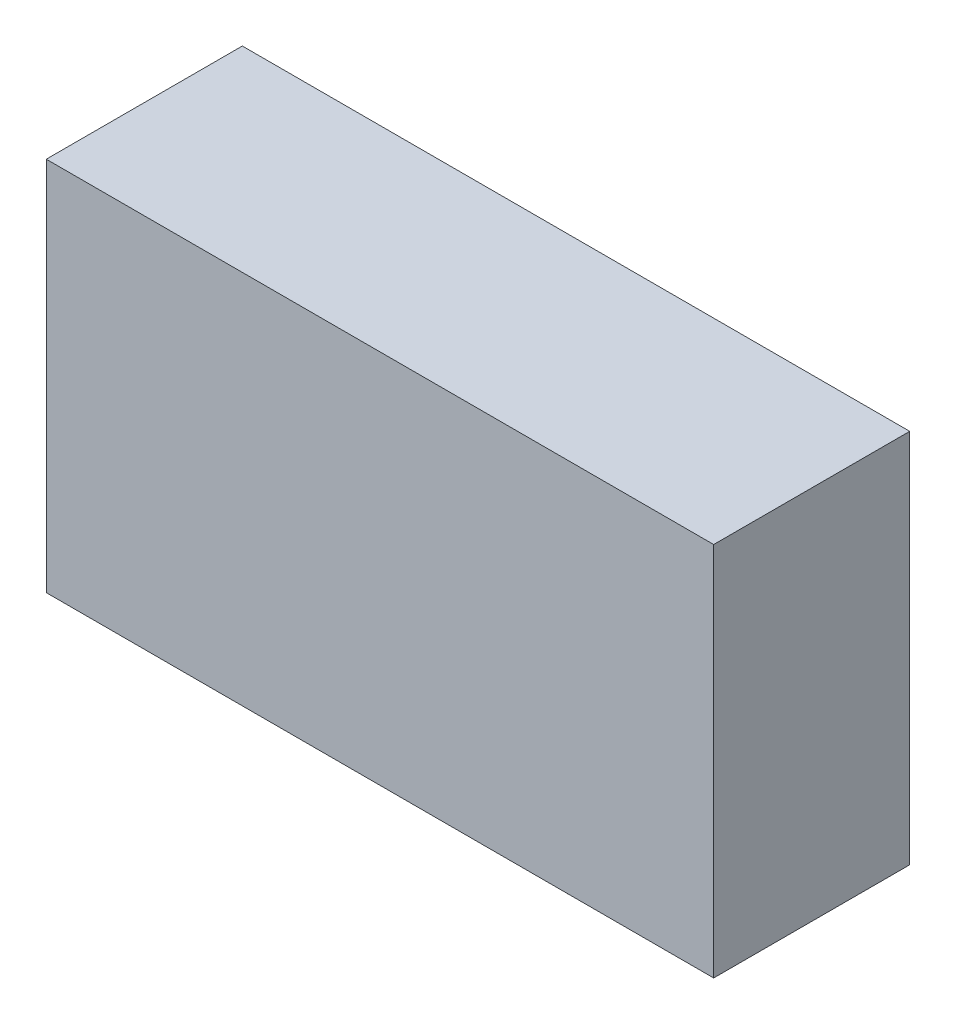
ISO-10303-21;
HEADER;
FILE_DESCRIPTION(('STEP AP214'),'2;1');
FILE_NAME('part.step','',(''),(''),'','','');
FILE_SCHEMA(('AUTOMOTIVE_DESIGN { 1 0 10303 214 1 1 1 1 }'));
ENDSEC;
DATA;
#1=APPLICATION_CONTEXT('core data for automotive mechanical design processes');
#2=APPLICATION_PROTOCOL_DEFINITION('international standard','automotive_design',2000,#1);
#3=PRODUCT_CONTEXT('',#1,'mechanical');
#4=PRODUCT('Part','Part','',(#3));
#5=PRODUCT_RELATED_PRODUCT_CATEGORY('part','',(#4));
#6=PRODUCT_DEFINITION_FORMATION('','',#4);
#7=PRODUCT_DEFINITION_CONTEXT('part definition',#1,'design');
#8=PRODUCT_DEFINITION('design','',#6,#7);
#9=PRODUCT_DEFINITION_SHAPE('','',#8);
#10=(LENGTH_UNIT() NAMED_UNIT(*) SI_UNIT(.MILLI.,.METRE.));
#11=(NAMED_UNIT(*) PLANE_ANGLE_UNIT() SI_UNIT($,.RADIAN.));
#12=(NAMED_UNIT(*) SI_UNIT($,.STERADIAN.) SOLID_ANGLE_UNIT());
#13=UNCERTAINTY_MEASURE_WITH_UNIT(LENGTH_MEASURE(1.E-05),#10,'distance_accuracy_value','');
#14=(GEOMETRIC_REPRESENTATION_CONTEXT(3) GLOBAL_UNCERTAINTY_ASSIGNED_CONTEXT((#13)) GLOBAL_UNIT_ASSIGNED_CONTEXT((#10,
#11,#12)) REPRESENTATION_CONTEXT('',''));
#15=CARTESIAN_POINT('',(0.,0.,0.));
#16=DIRECTION('',(0.,0.,1.));
#17=DIRECTION('',(1.,0.,0.));
#18=AXIS2_PLACEMENT_3D('',#15,#16,#17);
#19=CARTESIAN_POINT('',(0.,0.,2.35));
#20=DIRECTION('',(1.,0.,0.));
#21=DIRECTION('',(0.,0.,-1.));
#22=AXIS2_PLACEMENT_3D('',#19,#20,#21);
#23=PLANE('',#22);
#24=DIRECTION('',(0.,-1.,0.));
#25=VECTOR('',#24,1.);
#26=CARTESIAN_POINT('',(0.,0.,0.));
#27=LINE('',#26,#25);
#28=CARTESIAN_POINT('',(0.,4.49999999999996,0.));
#29=VERTEX_POINT('',#28);
#30=CARTESIAN_POINT('',(0.,0.,0.));
#31=VERTEX_POINT('',#30);
#32=EDGE_CURVE('E99',#29,#31,#27,.T.);
#33=ORIENTED_EDGE('',*,*,#32,.T.);
#34=DIRECTION('',(0.,0.,-1.));
#35=VECTOR('',#34,1.);
#36=CARTESIAN_POINT('',(0.,0.,2.35));
#37=LINE('',#36,#35);
#38=CARTESIAN_POINT('',(0.,0.,2.35));
#39=VERTEX_POINT('',#38);
#40=EDGE_CURVE('E11',#39,#31,#37,.T.);
#41=ORIENTED_EDGE('',*,*,#40,.F.);
#42=DIRECTION('',(0.,-1.,0.));
#43=VECTOR('',#42,1.);
#44=CARTESIAN_POINT('',(0.,0.,2.35));
#45=LINE('',#44,#43);
#46=CARTESIAN_POINT('',(0.,4.49999999999996,2.35));
#47=VERTEX_POINT('',#46);
#48=EDGE_CURVE('E87',#47,#39,#45,.T.);
#49=ORIENTED_EDGE('',*,*,#48,.F.);
#50=DIRECTION('',(0.,0.,-1.));
#51=VECTOR('',#50,1.);
#52=CARTESIAN_POINT('',(0.,4.49999999999996,2.35));
#53=LINE('',#52,#51);
#54=EDGE_CURVE('E95',#47,#29,#53,.T.);
#55=ORIENTED_EDGE('',*,*,#54,.T.);
#56=EDGE_LOOP('',(#33,#41,#49,#55));
#57=FACE_BOUND('',#56,.T.);
#58=ADVANCED_FACE('F36',(#57),#23,.F.);
#59=CARTESIAN_POINT('',(0.,0.,2.35));
#60=DIRECTION('',(0.,1.,0.));
#61=DIRECTION('',(0.,0.,1.));
#62=AXIS2_PLACEMENT_3D('',#59,#60,#61);
#63=PLANE('',#62);
#64=DIRECTION('',(1.,0.,0.));
#65=VECTOR('',#64,1.);
#66=CARTESIAN_POINT('',(0.,0.,0.));
#67=LINE('',#66,#65);
#68=CARTESIAN_POINT('',(8.,0.,0.));
#69=VERTEX_POINT('',#68);
#70=EDGE_CURVE('E91',#31,#69,#67,.T.);
#71=ORIENTED_EDGE('',*,*,#70,.T.);
#72=DIRECTION('',(0.,0.,-1.));
#73=VECTOR('',#72,1.);
#74=CARTESIAN_POINT('',(8.,0.,2.35));
#75=LINE('',#74,#73);
#76=CARTESIAN_POINT('',(8.,0.,2.35));
#77=VERTEX_POINT('',#76);
#78=EDGE_CURVE('E44',#77,#69,#75,.T.);
#79=ORIENTED_EDGE('',*,*,#78,.F.);
#80=DIRECTION('',(1.,0.,0.));
#81=VECTOR('',#80,1.);
#82=CARTESIAN_POINT('',(0.,0.,2.35));
#83=LINE('',#82,#81);
#84=EDGE_CURVE('E82',#39,#77,#83,.T.);
#85=ORIENTED_EDGE('',*,*,#84,.F.);
#86=ORIENTED_EDGE('',*,*,#40,.T.);
#87=EDGE_LOOP('',(#71,#79,#85,#86));
#88=FACE_BOUND('',#87,.T.);
#89=ADVANCED_FACE('F90',(#88),#63,.F.);
#90=CARTESIAN_POINT('',(8.,0.,2.35));
#91=DIRECTION('',(-1.,0.,0.));
#92=DIRECTION('',(0.,0.,1.));
#93=AXIS2_PLACEMENT_3D('',#90,#91,#92);
#94=PLANE('',#93);
#95=DIRECTION('',(0.,1.,0.));
#96=VECTOR('',#95,1.);
#97=CARTESIAN_POINT('',(8.,0.,0.));
#98=LINE('',#97,#96);
#99=CARTESIAN_POINT('',(8.,4.5,0.));
#100=VERTEX_POINT('',#99);
#101=EDGE_CURVE('E69',#69,#100,#98,.T.);
#102=ORIENTED_EDGE('',*,*,#101,.T.);
#103=DIRECTION('',(0.,0.,-1.));
#104=VECTOR('',#103,1.);
#105=CARTESIAN_POINT('',(8.00000000000009,4.5,2.35));
#106=LINE('',#105,#104);
#107=CARTESIAN_POINT('',(8.00000000000009,4.5,2.35));
#108=VERTEX_POINT('',#107);
#109=EDGE_CURVE('E92',#108,#100,#106,.T.);
#110=ORIENTED_EDGE('',*,*,#109,.F.);
#111=DIRECTION('',(0.,1.,0.));
#112=VECTOR('',#111,1.);
#113=CARTESIAN_POINT('',(8.,0.,2.35));
#114=LINE('',#113,#112);
#115=EDGE_CURVE('E85',#77,#108,#114,.T.);
#116=ORIENTED_EDGE('',*,*,#115,.F.);
#117=ORIENTED_EDGE('',*,*,#78,.T.);
#118=EDGE_LOOP('',(#102,#110,#116,#117));
#119=FACE_BOUND('',#118,.T.);
#120=ADVANCED_FACE('F93',(#119),#94,.F.);
#121=CARTESIAN_POINT('',(0.,4.49999999999996,2.35));
#122=DIRECTION('',(0.,-1.,0.));
#123=DIRECTION('',(0.,0.,-1.));
#124=AXIS2_PLACEMENT_3D('',#121,#122,#123);
#125=PLANE('',#124);
#126=DIRECTION('',(-1.,0.,0.));
#127=VECTOR('',#126,1.);
#128=CARTESIAN_POINT('',(0.,4.49999999999996,0.));
#129=LINE('',#128,#127);
#130=EDGE_CURVE('E75',#100,#29,#129,.T.);
#131=ORIENTED_EDGE('',*,*,#130,.T.);
#132=ORIENTED_EDGE('',*,*,#54,.F.);
#133=DIRECTION('',(-1.,0.,0.));
#134=VECTOR('',#133,1.);
#135=CARTESIAN_POINT('',(0.,4.49999999999996,2.35));
#136=LINE('',#135,#134);
#137=EDGE_CURVE('E52',#108,#47,#136,.T.);
#138=ORIENTED_EDGE('',*,*,#137,.F.);
#139=ORIENTED_EDGE('',*,*,#109,.T.);
#140=EDGE_LOOP('',(#131,#132,#138,#139));
#141=FACE_BOUND('',#140,.T.);
#142=ADVANCED_FACE('F106',(#141),#125,.F.);
#143=CARTESIAN_POINT('',(0.,0.,2.35));
#144=DIRECTION('',(0.,0.,-1.));
#145=DIRECTION('',(-1.,0.,0.));
#146=AXIS2_PLACEMENT_3D('',#143,#144,#145);
#147=PLANE('',#146);
#148=ORIENTED_EDGE('',*,*,#48,.T.);
#149=ORIENTED_EDGE('',*,*,#84,.T.);
#150=ORIENTED_EDGE('',*,*,#115,.T.);
#151=ORIENTED_EDGE('',*,*,#137,.T.);
#152=EDGE_LOOP('',(#148,#149,#150,#151));
#153=FACE_BOUND('',#152,.T.);
#154=ADVANCED_FACE('F83',(#153),#147,.F.);
#155=CARTESIAN_POINT('',(0.,0.,0.));
#156=DIRECTION('',(0.,0.,-1.));
#157=DIRECTION('',(-1.,0.,0.));
#158=AXIS2_PLACEMENT_3D('',#155,#156,#157);
#159=PLANE('',#158);
#160=ORIENTED_EDGE('',*,*,#32,.F.);
#161=ORIENTED_EDGE('',*,*,#130,.F.);
#162=ORIENTED_EDGE('',*,*,#101,.F.);
#163=ORIENTED_EDGE('',*,*,#70,.F.);
#164=EDGE_LOOP('',(#160,#161,#162,#163));
#165=FACE_BOUND('',#164,.T.);
#166=ADVANCED_FACE('F109',(#165),#159,.T.);
#167=CLOSED_SHELL('',(#58,#89,#120,#142,#154,#166));
#168=MANIFOLD_SOLID_BREP('B2',#167);
#169=ADVANCED_BREP_SHAPE_REPRESENTATION('',(#18,#168),#14);
#170=SHAPE_DEFINITION_REPRESENTATION(#9,#169);
ENDSEC;
END-ISO-10303-21;
